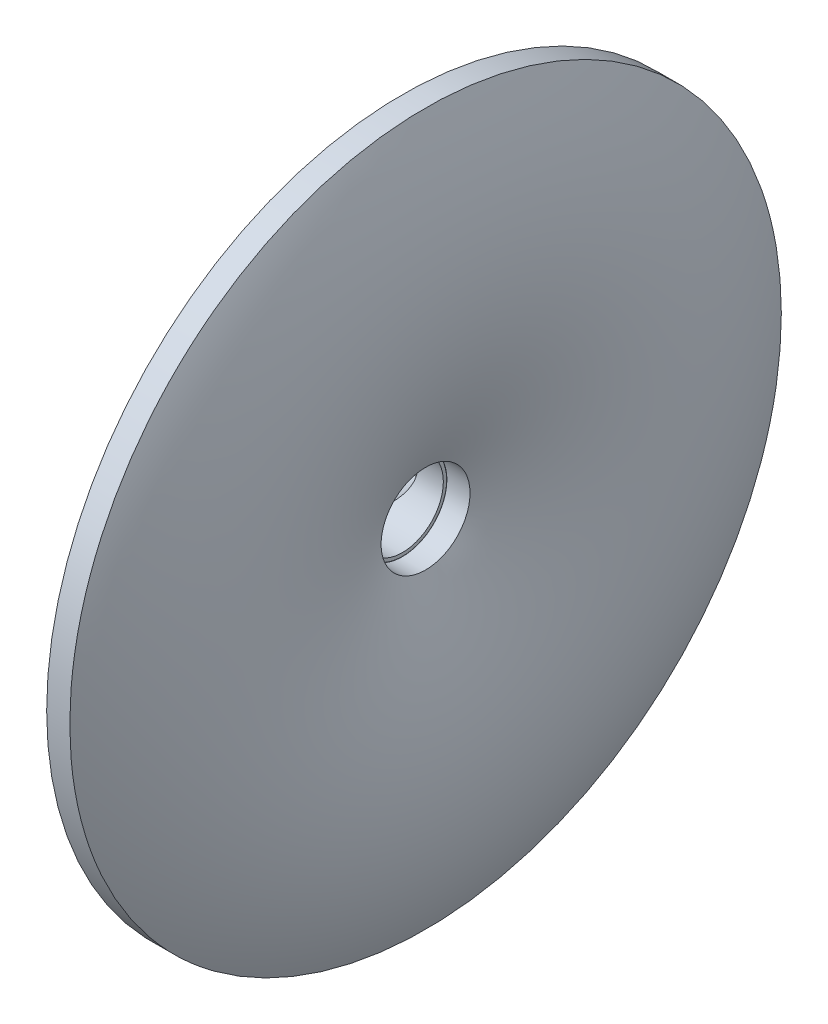
ISO-10303-21;
HEADER;
FILE_DESCRIPTION(('STEP AP214'),'2;1');
FILE_NAME('part.step','',(''),(''),'','','');
FILE_SCHEMA(('AUTOMOTIVE_DESIGN { 1 0 10303 214 1 1 1 1 }'));
ENDSEC;
DATA;
#1=APPLICATION_CONTEXT('core data for automotive mechanical design processes');
#2=APPLICATION_PROTOCOL_DEFINITION('international standard','automotive_design',2000,#1);
#3=PRODUCT_CONTEXT('',#1,'mechanical');
#4=PRODUCT('Part','Part','',(#3));
#5=PRODUCT_RELATED_PRODUCT_CATEGORY('part','',(#4));
#6=PRODUCT_DEFINITION_FORMATION('','',#4);
#7=PRODUCT_DEFINITION_CONTEXT('part definition',#1,'design');
#8=PRODUCT_DEFINITION('design','',#6,#7);
#9=PRODUCT_DEFINITION_SHAPE('','',#8);
#10=(LENGTH_UNIT() NAMED_UNIT(*) SI_UNIT(.MILLI.,.METRE.));
#11=(NAMED_UNIT(*) PLANE_ANGLE_UNIT() SI_UNIT($,.RADIAN.));
#12=(NAMED_UNIT(*) SI_UNIT($,.STERADIAN.) SOLID_ANGLE_UNIT());
#13=UNCERTAINTY_MEASURE_WITH_UNIT(LENGTH_MEASURE(1.E-05),#10,'distance_accuracy_value','');
#14=(GEOMETRIC_REPRESENTATION_CONTEXT(3) GLOBAL_UNCERTAINTY_ASSIGNED_CONTEXT((#13)) GLOBAL_UNIT_ASSIGNED_CONTEXT((#10,
#11,#12)) REPRESENTATION_CONTEXT('',''));
#15=CARTESIAN_POINT('',(0.,0.,0.));
#16=DIRECTION('',(0.,0.,1.));
#17=DIRECTION('',(1.,0.,0.));
#18=AXIS2_PLACEMENT_3D('',#15,#16,#17);
#19=CARTESIAN_POINT('',(25.9999999999999,0.,-50.));
#20=CARTESIAN_POINT('',(25.9999999999999,100.,-50.));
#21=CARTESIAN_POINT('',(25.9999999999999,100.,50.));
#22=CARTESIAN_POINT('',(25.9999999999999,0.,50.));
#23=CARTESIAN_POINT('',(25.9999999999999,-100.,50.));
#24=CARTESIAN_POINT('',(25.9999999999999,-100.,-50.));
#25=CARTESIAN_POINT('',(25.9999999999999,0.,-50.));
#26=CARTESIAN_POINT('',(108.308580160765,0.,-233.357652759936));
#27=CARTESIAN_POINT('',(108.308580160765,466.715305519872,-233.357652759936));
#28=CARTESIAN_POINT('',(108.308580160765,466.715305519872,233.357652759936));
#29=CARTESIAN_POINT('',(108.308580160765,0.,233.357652759936));
#30=CARTESIAN_POINT('',(108.308580160765,-466.715305519872,233.357652759936));
#31=CARTESIAN_POINT('',(108.308580160765,-466.715305519872,-233.357652759936));
#32=CARTESIAN_POINT('',(108.308580160765,0.,-233.357652759936));
#33=CARTESIAN_POINT('',(25.9999999999999,0.,-400.));
#34=CARTESIAN_POINT('',(25.9999999999999,800.,-400.));
#35=CARTESIAN_POINT('',(25.9999999999999,800.,400.));
#36=CARTESIAN_POINT('',(25.9999999999999,0.,400.));
#37=CARTESIAN_POINT('',(25.9999999999999,-800.,400.));
#38=CARTESIAN_POINT('',(25.9999999999999,-800.,-400.));
#39=CARTESIAN_POINT('',(25.9999999999999,0.,-400.));
#40=(BOUNDED_SURFACE() B_SPLINE_SURFACE(2,3,((#19,#20,#21,#22,#23,#24,#25),(#26,#27,#28,#29,#30,
#31,#32),(#33,#34,#35,#36,#37,#38,#39)),.UNSPECIFIED.,.F.,.T.,
.F.) B_SPLINE_SURFACE_WITH_KNOTS((3,3),(4,3,4),(0.,1.),(0.,0.5,1.),
.UNSPECIFIED.) GEOMETRIC_REPRESENTATION_ITEM() RATIONAL_B_SPLINE_SURFACE(((1.,0.333333333333333,
0.333333333333333,1.,0.333333333333333,0.333333333333333,1.),(1.,0.333333333333333,
0.333333333333333,1.,0.333333333333333,0.333333333333333,1.),(1.,0.333333333333333,
0.333333333333333,1.,0.333333333333333,0.333333333333333,1.))) REPRESENTATION_ITEM('') SURFACE());
#41=CARTESIAN_POINT('',(25.9999999999999,0.,-50.));
#42=CARTESIAN_POINT('',(108.308580160765,0.,-233.357652759936));
#43=CARTESIAN_POINT('',(25.9999999999999,0.,-400.));
#44=B_SPLINE_CURVE_WITH_KNOTS('',2,(#41,#42,#43),.UNSPECIFIED.,.F.,.F.,(3,3),(0.,1.),.UNSPECIFIED.);
#45=CARTESIAN_POINT('',(25.9999999999999,0.,-50.));
#46=VERTEX_POINT('',#45);
#47=CARTESIAN_POINT('',(25.9999999999999,0.,-400.));
#48=VERTEX_POINT('',#47);
#49=EDGE_CURVE('E97',#46,#48,#44,.T.);
#50=CARTESIAN_POINT('',(25.9999999999999,0.,0.));
#51=DIRECTION('',(1.,0.,0.));
#52=DIRECTION('',(0.,0.,-1.));
#53=AXIS2_PLACEMENT_3D('',#50,#51,#52);
#54=CIRCLE('',#53,50.);
#55=EDGE_CURVE('E84',#46,#46,#54,.T.);
#56=CARTESIAN_POINT('',(25.9999999999999,0.,0.));
#57=DIRECTION('',(1.,0.,0.));
#58=DIRECTION('',(0.,0.,-1.));
#59=AXIS2_PLACEMENT_3D('',#56,#57,#58);
#60=CIRCLE('',#59,400.);
#61=EDGE_CURVE('E15',#48,#48,#60,.T.);
#62=ORIENTED_EDGE('',*,*,#49,.F.);
#63=ORIENTED_EDGE('',*,*,#55,.F.);
#64=ORIENTED_EDGE('',*,*,#49,.T.);
#65=ORIENTED_EDGE('',*,*,#61,.T.);
#66=EDGE_LOOP('',(#62,#63,#64,#65));
#67=FACE_BOUND('',#66,.T.);
#68=ADVANCED_FACE('F81',(#67),#40,.T.);
#69=OPEN_SHELL('',(#68));
#70=SHELL_BASED_SURFACE_MODEL('B2',(#69));
#71=CARTESIAN_POINT('',(-76.7162892380863,0.,-83.1541397979577));
#72=DIRECTION('',(0.,0.,1.));
#73=DIRECTION('',(1.,0.,0.));
#74=AXIS2_PLACEMENT_3D('',#71,#72,#73);
#75=PLANE('',#74);
#76=CARTESIAN_POINT('',(-76.7162892380863,0.,-83.1541397979577));
#77=DIRECTION('',(0.,0.,-1.));
#78=DIRECTION('',(-1.,0.,0.));
#79=AXIS2_PLACEMENT_3D('',#76,#77,#78);
#80=CIRCLE('',#79,48.);
#81=CARTESIAN_POINT('',(-124.716289238086,0.,-83.1541397979577));
#82=VERTEX_POINT('',#81);
#83=EDGE_CURVE('E192',#82,#82,#80,.T.);
#84=ORIENTED_EDGE('',*,*,#83,.F.);
#85=EDGE_LOOP('',(#84));
#86=FACE_BOUND('',#85,.T.);
#87=CARTESIAN_POINT('',(-76.7162892380863,0.,-83.1541397979577));
#88=DIRECTION('',(0.,0.,1.));
#89=DIRECTION('',(1.,0.,0.));
#90=AXIS2_PLACEMENT_3D('',#87,#88,#89);
#91=CIRCLE('',#90,49.7455757095759);
#92=CARTESIAN_POINT('',(-26.9707135285104,0.,-83.1541397979577));
#93=VERTEX_POINT('',#92);
#94=EDGE_CURVE('E159',#93,#93,#91,.T.);
#95=ORIENTED_EDGE('',*,*,#94,.F.);
#96=EDGE_LOOP('',(#95));
#97=FACE_BOUND('',#96,.T.);
#98=ADVANCED_FACE('F140',(#86,#97),#75,.F.);
#99=CARTESIAN_POINT('',(0.,0.,0.));
#100=DIRECTION('',(1.,0.,0.));
#101=DIRECTION('',(0.,0.,-1.));
#102=AXIS2_PLACEMENT_3D('',#99,#100,#101);
#103=PLANE('',#102);
#104=CARTESIAN_POINT('',(0.,0.,0.));
#105=DIRECTION('',(1.,0.,0.));
#106=DIRECTION('',(0.,0.,-1.));
#107=AXIS2_PLACEMENT_3D('',#104,#105,#106);
#108=CIRCLE('',#107,46.);
#109=CARTESIAN_POINT('',(0.,0.,-46.));
#110=VERTEX_POINT('',#109);
#111=EDGE_CURVE('E185',#110,#110,#108,.T.);
#112=ORIENTED_EDGE('',*,*,#111,.F.);
#113=EDGE_LOOP('',(#112));
#114=FACE_BOUND('',#113,.T.);
#115=CARTESIAN_POINT('',(0.,0.,0.));
#116=DIRECTION('',(1.,0.,0.));
#117=DIRECTION('',(0.,0.,-1.));
#118=AXIS2_PLACEMENT_3D('',#115,#116,#117);
#119=CIRCLE('',#118,49.7455757095759);
#120=CARTESIAN_POINT('',(0.,0.,-49.7455757095759));
#121=VERTEX_POINT('',#120);
#122=EDGE_CURVE('E194',#121,#121,#119,.T.);
#123=ORIENTED_EDGE('',*,*,#122,.T.);
#124=EDGE_LOOP('',(#123));
#125=FACE_BOUND('',#124,.T.);
#126=ADVANCED_FACE('F238',(#114,#125),#103,.T.);
#127=CARTESIAN_POINT('',(-32.3050388317123,0.,49.3125689132431));
#128=CARTESIAN_POINT('',(-26.9707135285104,0.,-83.1541397979577));
#129=CARTESIAN_POINT('',(-32.3050388317123,99.4911514191517,49.3125689132431));
#130=CARTESIAN_POINT('',(-26.9707135285104,99.4911514191517,-83.1541397979577));
#131=CARTESIAN_POINT('',(-131.796190250864,99.4911514191517,49.3125689132431));
#132=CARTESIAN_POINT('',(-126.461864947662,99.4911514191517,-83.1541397979577));
#133=CARTESIAN_POINT('',(-131.796190250864,0.,49.3125689132431));
#134=CARTESIAN_POINT('',(-126.461864947662,0.,-83.1541397979577));
#135=CARTESIAN_POINT('',(-131.796190250864,-99.4911514191517,49.3125689132431));
#136=CARTESIAN_POINT('',(-126.461864947662,-99.4911514191517,-83.1541397979577));
#137=CARTESIAN_POINT('',(-32.3050388317123,-99.4911514191517,49.3125689132431));
#138=CARTESIAN_POINT('',(-26.9707135285104,-99.4911514191517,-83.1541397979577));
#139=CARTESIAN_POINT('',(-32.3050388317123,0.,49.3125689132431));
#140=CARTESIAN_POINT('',(-26.9707135285104,0.,-83.1541397979577));
#141=(BOUNDED_SURFACE() B_SPLINE_SURFACE(3,1,((#127,#128),(#129,#130),(#131,#132),(#133,#134),
(#135,#136),(#137,#138),(#139,#140)),.UNSPECIFIED.,.T.,.F.,.F.) B_SPLINE_SURFACE_WITH_KNOTS((4,
3,4),(2,2),(0.,0.5,1.),(0.,1.),
.UNSPECIFIED.) GEOMETRIC_REPRESENTATION_ITEM() RATIONAL_B_SPLINE_SURFACE(((1.,1.),
(0.333333333333333,0.333333333333333),(0.333333333333333,0.333333333333333),(1.,1.),
(0.333333333333333,0.333333333333333),(0.333333333333333,0.333333333333333),(1.,1.))) REPRESENTATION_ITEM('') SURFACE());
#142=CARTESIAN_POINT('',(-28.2702057478403,0.,-50.8839936208731));
#143=CARTESIAN_POINT('',(-28.2702055755946,-0.740094609916122,-50.8839937797835));
#144=CARTESIAN_POINT('',(-28.2873733905372,-1.48018612573514,-50.8681551088536));
#145=CARTESIAN_POINT('',(-28.3558743887472,-2.95744611573726,-50.8049575049274));
#146=CARTESIAN_POINT('',(-28.407208204199,-3.69461453557948,-50.7575979886908));
#147=CARTESIAN_POINT('',(-28.5435365125909,-5.16312607612669,-50.6318243114772));
#148=CARTESIAN_POINT('',(-28.6285297230418,-5.89446941769568,-50.5534113336979));
#149=CARTESIAN_POINT('',(-28.8314056429465,-7.34892657628311,-50.3662422067168));
#150=CARTESIAN_POINT('',(-28.949300449734,-8.07203726432385,-50.257474896765));
#151=CARTESIAN_POINT('',(-29.216889406493,-9.50727324737221,-50.0106028606461));
#152=CARTESIAN_POINT('',(-29.3665842389107,-10.2193983062703,-49.8724975048682));
#153=CARTESIAN_POINT('',(-29.6964811589979,-11.6304315263068,-49.5681414306949));
#154=CARTESIAN_POINT('',(-29.8766827418006,-12.3293399059599,-49.4018911780791));
#155=CARTESIAN_POINT('',(-30.2164619611026,-13.5356801442744,-49.0884178990771));
#156=CARTESIAN_POINT('',(-30.3695857532494,-14.046502775897,-48.947149055985));
#157=CARTESIAN_POINT('',(-30.6913112644889,-15.0590694461915,-48.6503317545796));
#158=CARTESIAN_POINT('',(-30.8599135050011,-15.5608131783422,-48.4947828152154));
#159=CARTESIAN_POINT('',(-31.211899903398,-16.5545259795851,-48.1700474452999));
#160=CARTESIAN_POINT('',(-31.3952822035472,-17.0464962674621,-48.0008627286571));
#161=CARTESIAN_POINT('',(-31.7761736133865,-18.0202435561059,-47.6494601931186));
#162=CARTESIAN_POINT('',(-31.9736843771145,-18.5020193548069,-47.4672408482415));
#163=CARTESIAN_POINT('',(-32.5864203720859,-19.931447850105,-46.9019432944333));
#164=CARTESIAN_POINT('',(-33.0218556830242,-20.8632195422209,-46.5002196840444));
#165=CARTESIAN_POINT('',(-33.9411118485304,-22.6815555084678,-45.6521329616248));
#166=CARTESIAN_POINT('',(-34.4249442568855,-23.5681089110479,-45.2057591903091));
#167=CARTESIAN_POINT('',(-35.286338052046,-25.0391801180414,-44.4110550938205));
#168=CARTESIAN_POINT('',(-35.6530522827088,-25.6355330596683,-44.0727321305188));
#169=CARTESIAN_POINT('',(-36.4061030192053,-26.8045648032843,-43.3779830987522));
#170=CARTESIAN_POINT('',(-36.7924353656918,-27.3772485771888,-43.0215608676149));
#171=CARTESIAN_POINT('',(-37.978871254156,-29.0601939480269,-41.9269796597157));
#172=CARTESIAN_POINT('',(-38.8062827213726,-30.135127884226,-41.1636269560244));
#173=CARTESIAN_POINT('',(-40.5232190069867,-32.1921273994419,-39.5796170557287));
#174=CARTESIAN_POINT('',(-41.4128449168767,-33.1740354270623,-38.7588665942046));
#175=CARTESIAN_POINT('',(-43.2432783279767,-35.0449911828831,-37.0701465937548));
#176=CARTESIAN_POINT('',(-44.1840871874406,-35.9340364449327,-36.2021758017322));
#177=CARTESIAN_POINT('',(-46.0346016078928,-37.5568374426403,-34.4949294774531));
#178=CARTESIAN_POINT('',(-46.9411598924783,-38.2972734326588,-33.6585575573006));
#179=CARTESIAN_POINT('',(-48.7854185628215,-39.7033137104837,-31.9570826586646));
#180=CARTESIAN_POINT('',(-49.7231288741018,-40.368893846013,-31.0919705230991));
#181=CARTESIAN_POINT('',(-51.6246582868012,-41.6270988245606,-29.3376588222768));
#182=CARTESIAN_POINT('',(-52.5884797417804,-42.2197170641955,-28.4484570856739));
#183=CARTESIAN_POINT('',(-54.5389153707376,-43.3344774565215,-26.6490255214138));
#184=CARTESIAN_POINT('',(-55.5255502903383,-43.8565522505559,-25.7387765542741));
#185=CARTESIAN_POINT('',(-57.5169703684399,-44.8313564749374,-23.9015335850439));
#186=CARTESIAN_POINT('',(-58.5217530939953,-45.2840951246632,-22.9745418275388));
#187=CARTESIAN_POINT('',(-60.5464679461563,-46.1219897708378,-21.1065817885024));
#188=CARTESIAN_POINT('',(-61.5664013947632,-46.5071398317138,-20.1656122873202));
#189=CARTESIAN_POINT('',(-63.8838542945738,-47.3022925319065,-18.0275781811471));
#190=CARTESIAN_POINT('',(-65.1849708387986,-47.692979730591,-16.8271949725451));
#191=CARTESIAN_POINT('',(-67.801755980709,-48.37189158548,-14.4130031318443));
#192=CARTESIAN_POINT('',(-69.1174275155699,-48.6600951568718,-13.1991917899683));
#193=CARTESIAN_POINT('',(-71.7586949378966,-49.1356863410714,-10.7624131037996));
#194=CARTESIAN_POINT('',(-73.0842918260236,-49.3230636460754,-9.53944483631772));
#195=CARTESIAN_POINT('',(-75.7426145827251,-49.5982355742918,-7.08693125146418));
#196=CARTESIAN_POINT('',(-77.0753470268072,-49.6859122020473,-5.85737986766532));
#197=CARTESIAN_POINT('',(-79.7421867363382,-49.7618061925821,-3.39700871831437));
#198=CARTESIAN_POINT('',(-81.0762938298116,-49.7500347695751,-2.16618911142323));
#199=CARTESIAN_POINT('',(-83.7419987513864,-49.6269902690049,0.293135106033791));
#200=CARTESIAN_POINT('',(-85.0735966433159,-49.5157197576582,1.52163977548616));
#201=CARTESIAN_POINT('',(-87.7387302876775,-49.1919830481155,3.98043694440377));
#202=CARTESIAN_POINT('',(-89.0722240660812,-48.978874852019,5.21069071949876));
#203=CARTESIAN_POINT('',(-91.7282625105164,-48.4499042119137,7.66109684510897));
#204=CARTESIAN_POINT('',(-93.0508065918097,-48.1340363161429,8.88124865615692));
#205=CARTESIAN_POINT('',(-95.6804590023915,-47.3975406782925,11.3073115727597));
#206=CARTESIAN_POINT('',(-96.9875631632826,-46.9768852939604,12.5132188326373));
#207=CARTESIAN_POINT('',(-99.5779098276257,-46.0293263856167,14.9030190808449));
#208=CARTESIAN_POINT('',(-100.861196937691,-45.5026493766679,16.0869532223136));
#209=CARTESIAN_POINT('',(-103.400387128014,-44.3395141965656,18.4295575658213));
#210=CARTESIAN_POINT('',(-104.656296152236,-43.7030801272395,19.5882332516388));
#211=CARTESIAN_POINT('',(-107.133239510804,-42.3170673459966,21.8734099558167));
#212=CARTESIAN_POINT('',(-108.354293623053,-41.5675543803029,22.9999292208617));
#213=CARTESIAN_POINT('',(-110.646020660022,-40.0236522876831,25.1142291781464));
#214=CARTESIAN_POINT('',(-111.720352741115,-39.2393330918135,26.1053857323618));
#215=CARTESIAN_POINT('',(-113.826022030423,-37.5701675201192,28.0480326604735));
#216=CARTESIAN_POINT('',(-114.85736360453,-36.6853313864384,28.9995270622521));
#217=CARTESIAN_POINT('',(-116.866920998366,-34.8129992126041,30.8535031437872));
#218=CARTESIAN_POINT('',(-117.845194629139,-33.8256184460284,31.7560381588178));
#219=CARTESIAN_POINT('',(-119.738903389325,-31.7448457395483,33.5031346874102));
#220=CARTESIAN_POINT('',(-120.654352455407,-30.6514774420408,34.3477090586558));
#221=CARTESIAN_POINT('',(-122.21393486313,-28.6130531900983,35.7865475262558));
#222=CARTESIAN_POINT('',(-122.873076323674,-27.6892236042301,36.3946578026502));
#223=CARTESIAN_POINT('',(-124.138711366886,-25.7768448115918,37.5623065123943));
#224=CARTESIAN_POINT('',(-124.745207951337,-24.7882993005328,38.1218477151251));
#225=CARTESIAN_POINT('',(-125.897279587358,-22.7487887940705,39.1847251745852));
#226=CARTESIAN_POINT('',(-126.442909878763,-21.6978817448603,39.6881123944418));
#227=CARTESIAN_POINT('',(-127.465476145115,-19.5358187153241,40.6315108788132));
#228=CARTESIAN_POINT('',(-127.942424595508,-18.424673727282,41.071533652915));
#229=CARTESIAN_POINT('',(-128.741897985936,-16.3475092508492,41.8091112648925));
#230=CARTESIAN_POINT('',(-129.07683077587,-15.3903063429373,42.1181133284144));
#231=CARTESIAN_POINT('',(-129.689401369305,-13.4423464875184,42.6832582861859));
#232=CARTESIAN_POINT('',(-129.967045277638,-12.451593128336,42.9394068126294));
#233=CARTESIAN_POINT('',(-130.337086239272,-10.9448437574599,43.2807989491074));
#234=CARTESIAN_POINT('',(-130.452686410512,-10.4392095238899,43.3874492757703));
#235=CARTESIAN_POINT('',(-130.667969208023,-9.42172332561556,43.5860647313803));
#236=CARTESIAN_POINT('',(-130.767653451993,-8.90987199851637,43.6780313527833));
#237=CARTESIAN_POINT('',(-130.950665088014,-7.88072403107055,43.846874102369));
#238=CARTESIAN_POINT('',(-131.033990651236,-7.36342678869798,43.9237485433121));
#239=CARTESIAN_POINT('',(-131.18387922435,-6.32440102269657,44.062032640249));
#240=CARTESIAN_POINT('',(-131.250443400907,-5.80267281009679,44.1234433725832));
#241=CARTESIAN_POINT('',(-131.386155952696,-4.57828941988709,44.2486489654929));
#242=CARTESIAN_POINT('',(-131.448539024913,-3.87422392760545,44.306202297454));
#243=CARTESIAN_POINT('',(-131.542126699418,-2.46226364536431,44.3925443499829));
#244=CARTESIAN_POINT('',(-131.573330402714,-1.75436874558342,44.4213322411591));
#245=CARTESIAN_POINT('',(-131.604277715833,-0.337312932844498,44.4498835920619));
#246=CARTESIAN_POINT('',(-131.604021992556,0.371847952957564,44.4496476670564));
#247=CARTESIAN_POINT('',(-131.572054104952,1.78884286481152,44.4201547552461));
#248=CARTESIAN_POINT('',(-131.540342235618,2.49667690324408,44.3908980405954));
#249=CARTESIAN_POINT('',(-131.445746323265,3.90849391657253,44.3036258086843));
#250=CARTESIAN_POINT('',(-131.382861731824,4.61247682349514,44.2456097854614));
#251=CARTESIAN_POINT('',(-131.226496043459,6.01403169394612,44.1013500359804));
#252=CARTESIAN_POINT('',(-131.133016862444,6.71160405610739,44.0151080773012));
#253=CARTESIAN_POINT('',(-130.872391874914,8.37856245183558,43.7746608551354));
#254=CARTESIAN_POINT('',(-130.690742677086,9.34380957185882,43.6070750628423));
#255=CARTESIAN_POINT('',(-130.271567961008,11.2513373111949,43.2203531409028));
#256=CARTESIAN_POINT('',(-130.034046572837,12.1936196223896,43.0012208215806));
#257=CARTESIAN_POINT('',(-129.50656412173,14.0508011023233,42.5145764237732));
#258=CARTESIAN_POINT('',(-129.216591395296,14.9656941277179,42.2470535847866));
#259=CARTESIAN_POINT('',(-128.588110058083,16.7640836213198,41.6672297039372));
#260=CARTESIAN_POINT('',(-128.249594271067,17.6475754232686,41.3549220414261));
#261=CARTESIAN_POINT('',(-127.400527176651,19.686369969669,40.5715903040528));
#262=CARTESIAN_POINT('',(-126.871445247466,20.8274479326022,40.0834702608572));
#263=CARTESIAN_POINT('',(-125.741605468711,23.0418846385777,39.0411034530203));
#264=CARTESIAN_POINT('',(-125.140827394219,24.1152241419641,38.4868380292829));
#265=CARTESIAN_POINT('',(-123.876048976088,26.1930654629875,37.3199796241189));
#266=CARTESIAN_POINT('',(-123.211955276727,27.1974617568163,36.7073005146342));
#267=CARTESIAN_POINT('',(-121.82985559783,29.1347562289716,35.4322039412132));
#268=CARTESIAN_POINT('',(-121.111847049767,30.0676509966517,34.7697841076079));
#269=CARTESIAN_POINT('',(-119.357598604249,32.1913681945315,33.15135078043));
#270=CARTESIAN_POINT('',(-118.301175086245,33.3514051276301,32.1767162960605));
#271=CARTESIAN_POINT('',(-116.117958337258,35.5416202014967,30.1625256858078));
#272=CARTESIAN_POINT('',(-114.991140916539,36.5717533317486,29.1229472429733));
#273=CARTESIAN_POINT('',(-112.679387535549,38.5072123444485,26.9901713949626));
#274=CARTESIAN_POINT('',(-111.494383339757,39.4123867086059,25.8969110371066));
#275=CARTESIAN_POINT('',(-109.078570467917,41.1009557763588,23.6681320554295));
#276=CARTESIAN_POINT('',(-107.847761241912,41.8843490172063,22.5326129242293));
#277=CARTESIAN_POINT('',(-105.472379056574,43.2623931767567,20.3411344575628));
#278=CARTESIAN_POINT('',(-104.331226456119,43.8680285609296,19.2883306744435));
#279=CARTESIAN_POINT('',(-102.024382316605,44.9868760505878,17.1600839910653));
#280=CARTESIAN_POINT('',(-100.858683796129,45.500061453539,16.0846346498959));
#281=CARTESIAN_POINT('',(-98.5078258597499,46.436351476447,13.9157817480066));
#282=CARTESIAN_POINT('',(-97.3226642749192,46.8594459824582,12.8223761862793));
#283=CARTESIAN_POINT('',(-94.9364223739051,47.6178629520361,10.620878770576));
#284=CARTESIAN_POINT('',(-93.7353313966931,47.9531231561888,9.51277708095547));
#285=CARTESIAN_POINT('',(-91.322047575552,48.5371234905869,7.28633134913634));
#286=CARTESIAN_POINT('',(-90.1098563458371,48.785876002099,6.16798879617829));
#287=CARTESIAN_POINT('',(-87.677710563649,49.1981805203022,3.92414140927866));
#288=CARTESIAN_POINT('',(-86.4577561172165,49.3617336882452,2.79863667316802));
#289=CARTESIAN_POINT('',(-83.9917261678339,49.6066174822724,0.523528454547948));
#290=CARTESIAN_POINT('',(-82.7455700442783,49.6864439969149,-0.626149406864497));
#291=CARTESIAN_POINT('',(-80.2518614376591,49.7591396954724,-2.9267933820861));
#292=CARTESIAN_POINT('',(-79.0043089188172,49.7520065978445,-4.07775952890357));
#293=CARTESIAN_POINT('',(-76.5110013842016,49.6507362330504,-6.37803348339117));
#294=CARTESIAN_POINT('',(-75.2652465306044,49.5565915543452,-7.52734114144073));
#295=CARTESIAN_POINT('',(-72.7793826289665,49.280840050184,-9.82074775412333));
#296=CARTESIAN_POINT('',(-71.5392718258651,49.0992625991759,-10.9648483279392));
#297=CARTESIAN_POINT('',(-69.0678505357407,48.6477273681166,-13.2449304860016));
#298=CARTESIAN_POINT('',(-67.8365393968664,48.3777762053299,-14.3809126716326));
#299=CARTESIAN_POINT('',(-65.3864955202233,47.7481145396742,-16.6412724702336));
#300=CARTESIAN_POINT('',(-64.1677610440924,47.3884166195636,-17.7656516869805));
#301=CARTESIAN_POINT('',(-61.9401745996483,46.6421486698508,-19.8207768604239));
#302=CARTESIAN_POINT('',(-60.928879445235,46.2690378270316,-20.7537768500763));
#303=CARTESIAN_POINT('',(-58.9207386305247,45.4567589510322,-22.6064460250138));
#304=CARTESIAN_POINT('',(-57.9238921455068,45.017594704547,-23.5261159711694));
#305=CARTESIAN_POINT('',(-55.9475218050361,44.0715619065727,-25.3494743637825));
#306=CARTESIAN_POINT('',(-54.9680002860755,43.5646843007342,-26.2531606546405));
#307=CARTESIAN_POINT('',(-53.0309314247439,42.4820868741844,-28.0402603155964));
#308=CARTESIAN_POINT('',(-52.0733611953734,41.9064430425642,-28.9236948007665));
#309=CARTESIAN_POINT('',(-50.183123181233,40.6839925247134,-30.667589290854));
#310=CARTESIAN_POINT('',(-49.2504530698816,40.0371925161938,-31.5280514422273));
#311=CARTESIAN_POINT('',(-47.414786386396,38.670571771931,-33.2215995515237));
#312=CARTESIAN_POINT('',(-46.5117805973294,37.9507740067555,-34.0546940127978));
#313=CARTESIAN_POINT('',(-44.6787726655026,36.3832121700229,-35.7457892128132));
#314=CARTESIAN_POINT('',(-43.7512622679666,35.5300294769535,-36.6014911189552));
#315=CARTESIAN_POINT('',(-41.9435250510586,33.735304049224,-38.2692720801404));
#316=CARTESIAN_POINT('',(-41.0632958398354,32.7937657909098,-39.0813533418561));
#317=CARTESIAN_POINT('',(-39.3599608252333,30.8215933893271,-40.6528149908741));
#318=CARTESIAN_POINT('',(-38.5367935829088,29.791057842878,-41.4122520604767));
#319=CARTESIAN_POINT('',(-36.957076473736,27.6393543617732,-42.869666387125));
#320=CARTESIAN_POINT('',(-36.2005110589694,26.5182076977502,-43.5676579883584));
#321=CARTESIAN_POINT('',(-34.9235870393149,24.4425607148238,-44.7457216742422));
#322=CARTESIAN_POINT('',(-34.3878484363749,23.5055525212815,-45.2399830269423));
#323=CARTESIAN_POINT('',(-33.3705085299567,21.5785745190256,-46.1785597797517));
#324=CARTESIAN_POINT('',(-32.8889019602959,20.5886098759825,-46.6228800383321));
#325=CARTESIAN_POINT('',(-31.9866772100379,18.5588610957179,-47.4552539293582));
#326=CARTESIAN_POINT('',(-31.5660262486608,17.5191041391656,-47.8433378046732));
#327=CARTESIAN_POINT('',(-30.9858120915162,15.925507770092,-48.3786313836543));
#328=CARTESIAN_POINT('',(-30.8008479622504,15.3885801240817,-48.5492754631181));
#329=CARTESIAN_POINT('',(-30.4486488808819,14.3040853002637,-48.8742070499435));
#330=CARTESIAN_POINT('',(-30.2814124119748,13.7565190374628,-49.0284959566776));
#331=CARTESIAN_POINT('',(-29.9232328568344,12.5038272151976,-49.3589450048919));
#332=CARTESIAN_POINT('',(-29.7379037714003,11.7957130883057,-49.529925785367));
#333=CARTESIAN_POINT('',(-29.3985621719356,10.3657296113422,-49.8429953253599));
#334=CARTESIAN_POINT('',(-29.2445492185352,9.64386045441104,-49.9850844902311));
#335=CARTESIAN_POINT('',(-28.9692026640311,8.18866845756201,-50.2391135255548));
#336=CARTESIAN_POINT('',(-28.8478682517899,7.45534590241532,-50.351054144346));
#337=CARTESIAN_POINT('',(-28.6390670936205,5.98019462604617,-50.5436897735797));
#338=CARTESIAN_POINT('',(-28.5515833685069,5.23837036196346,-50.6244004486675));
#339=CARTESIAN_POINT('',(-28.4112502683483,3.74863968873355,-50.7538688639215));
#340=CARTESIAN_POINT('',(-28.358402289151,3.00073303569088,-50.8026253163074));
#341=CARTESIAN_POINT('',(-28.2878809305943,1.50188309847576,-50.8676868628959));
#342=CARTESIAN_POINT('',(-28.2702059226102,0.750939956516218,-50.8839934596341));
#343=CARTESIAN_POINT('',(-28.2702057478403,0.,-50.8839936208731));
#344=B_SPLINE_CURVE_WITH_KNOTS('',3,(#142,#143,#144,#145,#146,#147,#148,#149,#150,#151,#152,
#153,#154,#155,#156,#157,#158,#159,#160,#161,#162,#163,#164,#165,#166,#167,#168,#169,#170,#171,
#172,#173,#174,#175,#176,#177,#178,#179,#180,#181,#182,#183,#184,#185,#186,#187,#188,#189,#190,
#191,#192,#193,#194,#195,#196,#197,#198,#199,#200,#201,#202,#203,#204,#205,#206,#207,#208,#209,
#210,#211,#212,#213,#214,#215,#216,#217,#218,#219,#220,#221,#222,#223,#224,#225,#226,#227,#228,
#229,#230,#231,#232,#233,#234,#235,#236,#237,#238,#239,#240,#241,#242,#243,#244,#245,#246,#247,
#248,#249,#250,#251,#252,#253,#254,#255,#256,#257,#258,#259,#260,#261,#262,#263,#264,#265,#266,
#267,#268,#269,#270,#271,#272,#273,#274,#275,#276,#277,#278,#279,#280,#281,#282,#283,#284,#285,
#286,#287,#288,#289,#290,#291,#292,#293,#294,#295,#296,#297,#298,#299,#300,#301,#302,#303,#304,
#305,#306,#307,#308,#309,#310,#311,#312,#313,#314,#315,#316,#317,#318,#319,#320,#321,#322,#323,
#324,#325,#326,#327,#328,#329,#330,#331,#332,#333,#334,#335,#336,#337,#338,#339,#340,#341,#342,
#343),.UNSPECIFIED.,.T.,.F.,(4,2,2,2,2,2,2,2,2,2,2,2,2,2,2,2,2,2,2,2,2,2,2,2,2,2,2,2,2,2,2,2,2,
2,2,2,2,2,2,2,2,2,2,2,2,2,2,2,2,2,2,2,2,2,2,2,2,2,2,2,2,2,2,2,2,2,2,2,2,2,2,2,2,2,2,2,2,2,2,2,2,
2,2,2,2,2,2,2,2,2,2,2,2,2,2,2,2,2,2,2,4),(0.,2.21991187123897,4.43986481935833,6.65973319104599,
8.88041884678375,11.1011521644833,13.3218487340822,14.9764127996444,16.6310326226481,
18.2854447964944,19.9400509725599,23.2492038231756,26.5591485583007,28.8909700627334,
31.2222992320518,35.8858077020844,40.5570782844293,45.228472889905,49.541644802514,
53.8562043936926,58.1711541855356,62.4901954379599,66.8086619033993,71.1275074233387,
76.5628547650897,81.999319720129,87.4363403574738,92.8797890174452,98.322623857625,
103.765318323759,109.242786199959,114.720544722419,120.199749774711,125.667370438941,
131.133791979941,136.597047401269,141.569825793875,146.542097940407,151.508839892721,
156.474476463636,160.333831757062,164.192966847486,168.048570545113,171.903473020898,
175.080856421525,178.257901057837,179.846102578383,181.434142570767,183.022359998094,
184.610466848103,186.736632935362,188.862860324431,190.989042640195,193.115205017021,
195.241404800752,197.367471461988,200.35317275111,203.338653406221,206.324798754553,
209.311386007916,213.352942621404,217.395642033496,221.444397206026,225.493345385485,
231.026304004861,236.561174508293,242.102698432157,247.644288911713,252.640991287944,
257.639134567023,262.637838661126,267.640076448537,272.641598004222,277.643051388271,
282.732890291457,287.822862736073,292.913268778213,298.00196580845,303.090281893321,
308.177884981833,312.453215268267,316.728300552865,321.003958057386,325.274933771518,
329.545509013712,333.814744558108,338.380962564619,342.946949358216,347.507941009621,
352.067865077328,355.6261316419,359.184051743785,362.74005130512,364.518492289965,
366.296780985779,368.550456393078,370.804100178812,373.057688020079,375.310144013068,
377.562690776218,379.815133236577),.UNSPECIFIED.);
#345=CARTESIAN_POINT('',(-28.2702057478403,0.,-50.8839936208732));
#346=VERTEX_POINT('',#345);
#347=EDGE_CURVE('E178',#346,#346,#344,.T.);
#348=ORIENTED_EDGE('',*,*,#347,.T.);
#349=EDGE_LOOP('',(#348));
#350=FACE_BOUND('',#349,.T.);
#351=ORIENTED_EDGE('',*,*,#94,.T.);
#352=EDGE_LOOP('',(#351));
#353=FACE_BOUND('',#352,.T.);
#354=ADVANCED_FACE('F233',(#350,#353),#141,.F.);
#355=CARTESIAN_POINT('',(0.,0.,-49.7455757095759));
#356=CARTESIAN_POINT('',(-136.866643183369,0.,-55.2570827516137));
#357=CARTESIAN_POINT('',(0.,99.4911514191517,-49.7455757095759));
#358=CARTESIAN_POINT('',(-136.866643183369,99.4911514191517,-55.2570827516137));
#359=CARTESIAN_POINT('',(0.,99.4911514191517,49.7455757095759));
#360=CARTESIAN_POINT('',(-136.866643183369,99.4911514191517,44.234068667538));
#361=CARTESIAN_POINT('',(0.,0.,49.7455757095759));
#362=CARTESIAN_POINT('',(-136.866643183369,0.,44.234068667538));
#363=CARTESIAN_POINT('',(0.,-99.4911514191517,49.7455757095759));
#364=CARTESIAN_POINT('',(-136.866643183369,-99.4911514191517,44.234068667538));
#365=CARTESIAN_POINT('',(0.,-99.4911514191517,-49.7455757095759));
#366=CARTESIAN_POINT('',(-136.866643183369,-99.4911514191517,-55.2570827516137));
#367=CARTESIAN_POINT('',(0.,0.,-49.7455757095759));
#368=CARTESIAN_POINT('',(-136.866643183369,0.,-55.2570827516137));
#369=(BOUNDED_SURFACE() B_SPLINE_SURFACE(3,1,((#355,#356),(#357,#358),(#359,#360),(#361,#362),
(#363,#364),(#365,#366),(#367,#368)),.UNSPECIFIED.,.T.,.F.,.F.) B_SPLINE_SURFACE_WITH_KNOTS((4,
3,4),(2,2),(0.,0.5,1.),(0.,1.),
.UNSPECIFIED.) GEOMETRIC_REPRESENTATION_ITEM() RATIONAL_B_SPLINE_SURFACE(((1.,1.),
(0.333333333333333,0.333333333333333),(0.333333333333333,0.333333333333333),(1.,1.),
(0.333333333333333,0.333333333333333),(0.333333333333333,0.333333333333333),(1.,1.))) REPRESENTATION_ITEM('') SURFACE());
#370=ORIENTED_EDGE('',*,*,#122,.F.);
#371=EDGE_LOOP('',(#370));
#372=FACE_BOUND('',#371,.T.);
#373=ORIENTED_EDGE('',*,*,#347,.F.);
#374=EDGE_LOOP('',(#373));
#375=FACE_BOUND('',#374,.T.);
#376=ADVANCED_FACE('F215',(#372,#375),#369,.F.);
#377=CARTESIAN_POINT('',(-76.7162892380863,0.,-3.15413979795767));
#378=DIRECTION('',(0.,0.,-1.));
#379=DIRECTION('',(-1.,0.,0.));
#380=AXIS2_PLACEMENT_3D('',#377,#378,#379);
#381=CYLINDRICAL_SURFACE('',#380,48.);
#382=CARTESIAN_POINT('',(-76.7162892380863,0.,-3.15413979795767));
#383=DIRECTION('',(0.,0.,-1.));
#384=DIRECTION('',(-1.,0.,0.));
#385=AXIS2_PLACEMENT_3D('',#382,#383,#384);
#386=CIRCLE('',#385,48.);
#387=CARTESIAN_POINT('',(-62.6468685725059,-45.8917356626979,-3.15413979795767));
#388=VERTEX_POINT('',#387);
#389=CARTESIAN_POINT('',(-62.6468685725059,45.8917356626979,-3.15413979795767));
#390=VERTEX_POINT('',#389);
#391=EDGE_CURVE('E190',#388,#390,#386,.T.);
#392=ORIENTED_EDGE('',*,*,#391,.F.);
#393=CARTESIAN_POINT('',(-62.6468685725059,-45.8917356626979,-3.15413979795767));
#394=CARTESIAN_POINT('',(-62.5527147058752,-45.8628671450584,-3.57427896842205));
#395=CARTESIAN_POINT('',(-62.4416341250417,-45.8285012217468,-3.98985315460026));
#396=CARTESIAN_POINT('',(-62.1908157250914,-45.7496216632609,-4.81056786201394));
#397=CARTESIAN_POINT('',(-62.0511262719425,-45.7051251408156,-5.21572471033678));
#398=CARTESIAN_POINT('',(-61.7489509735667,-45.6070584540113,-6.01303889769735));
#399=CARTESIAN_POINT('',(-61.5866238443152,-45.5535509666206,-6.40526505673957));
#400=CARTESIAN_POINT('',(-61.2426923043469,-45.4378790425387,-7.18000876637749));
#401=CARTESIAN_POINT('',(-61.0610789830454,-45.3757106001492,-7.56252172727361));
#402=CARTESIAN_POINT('',(-60.4973055723069,-45.1785453010313,-8.68764768358985));
#403=CARTESIAN_POINT('',(-60.0925918736837,-45.0317446721343,-9.41689494784052));
#404=CARTESIAN_POINT('',(-59.2429967486166,-44.708966752493,-10.8464886539056));
#405=CARTESIAN_POINT('',(-58.7980288992225,-44.5329259741214,-11.5467679736777));
#406=CARTESIAN_POINT('',(-57.8900785363258,-44.1566670773562,-12.9104650252057));
#407=CARTESIAN_POINT('',(-57.4275399319807,-43.9569190814847,-13.5743105277373));
#408=CARTESIAN_POINT('',(-56.4860116193986,-43.5316316609087,-14.8818573269903));
#409=CARTESIAN_POINT('',(-56.0070187610614,-43.3060872781198,-15.5255547208477));
#410=CARTESIAN_POINT('',(-55.038747033959,-42.8296086365581,-16.7953655837931));
#411=CARTESIAN_POINT('',(-54.5494697460981,-42.5786782577886,-17.4214817213733));
#412=CARTESIAN_POINT('',(-53.564964607935,-42.0514925639869,-18.65807186086));
#413=CARTESIAN_POINT('',(-53.0697371936838,-41.7752390950221,-19.2685469988592));
#414=CARTESIAN_POINT('',(-52.0720425847419,-41.1946276647139,-20.4806825168986));
#415=CARTESIAN_POINT('',(-51.5695507466933,-40.8900339553913,-21.082209634758));
#416=CARTESIAN_POINT('',(-50.5645874916669,-40.2547134358168,-22.2713365964849));
#417=CARTESIAN_POINT('',(-50.0621160752642,-39.9239861252929,-22.8589361734595));
#418=CARTESIAN_POINT('',(-49.0595782691565,-39.2361545067273,-24.0203997349699));
#419=CARTESIAN_POINT('',(-48.5595114692864,-38.8790548803593,-24.594266133616));
#420=CARTESIAN_POINT('',(-47.5637457497137,-38.1380970862057,-25.7282765581281));
#421=CARTESIAN_POINT('',(-47.0680467629228,-37.7542393302272,-26.2884207949987));
#422=CARTESIAN_POINT('',(-45.6444496245331,-36.6056187928361,-27.8870302492087));
#423=CARTESIAN_POINT('',(-44.7244048913135,-35.8058152767661,-28.9076635709713));
#424=CARTESIAN_POINT('',(-42.9182603927874,-34.1061817087569,-30.894616297523));
#425=CARTESIAN_POINT('',(-42.0321639178428,-33.206341993837,-31.8609304417624));
#426=CARTESIAN_POINT('',(-40.3093246351363,-31.3076639155761,-33.7282688941847));
#427=CARTESIAN_POINT('',(-39.4724014416209,-30.3092287939221,-34.6295350185772));
#428=CARTESIAN_POINT('',(-37.8572674622335,-28.2086928655683,-36.3609773440835));
#429=CARTESIAN_POINT('',(-37.0790352484705,-27.1066302263649,-37.1911795055188));
#430=CARTESIAN_POINT('',(-35.7964083478264,-25.1110453901433,-38.5548260711936));
#431=CARTESIAN_POINT('',(-35.2748982827145,-24.2417886665799,-39.1077826194682));
#432=CARTESIAN_POINT('',(-34.276845412218,-22.4487409563047,-40.163867064343));
#433=CARTESIAN_POINT('',(-33.8002989248481,-21.5249544450263,-40.6669990411539));
#434=CARTESIAN_POINT('',(-32.8989545629379,-19.6251407754003,-41.6170799994504));
#435=CARTESIAN_POINT('',(-32.4741357883555,-18.6491349466924,-42.0640516742623));
#436=CARTESIAN_POINT('',(-31.6829336684149,-16.6479398542123,-42.8954475631532));
#437=CARTESIAN_POINT('',(-31.3165422142819,-15.6227574410954,-43.2798804567612));
#438=CARTESIAN_POINT('',(-30.6984924612239,-13.6835402276143,-43.9277313810297));
#439=CARTESIAN_POINT('',(-30.4378787071792,-12.7755230576839,-44.2006394379437));
#440=CARTESIAN_POINT('',(-29.968051882956,-10.9319184565322,-44.6923142586881));
#441=CARTESIAN_POINT('',(-29.7588338811705,-9.99633368017741,-44.9110862170866));
#442=CARTESIAN_POINT('',(-29.3954447255965,-8.10345013173242,-45.2908972769875));
#443=CARTESIAN_POINT('',(-29.241246101591,-7.14616245016351,-45.451965189279));
#444=CARTESIAN_POINT('',(-28.9905908297957,-5.21582805792501,-45.7137147054986));
#445=CARTESIAN_POINT('',(-28.8941348287893,-4.24278117085968,-45.8143956330234));
#446=CARTESIAN_POINT('',(-28.7606516837043,-2.28520281658823,-45.9537112094503));
#447=CARTESIAN_POINT('',(-28.723804922292,-1.30064553792943,-45.9921575313152));
#448=CARTESIAN_POINT('',(-28.7108495515601,0.669307874959472,-46.0056762081555));
#449=CARTESIAN_POINT('',(-28.734741011894,1.65470401015027,-45.9807484904546));
#450=CARTESIAN_POINT('',(-28.8427806337293,3.61863271567588,-45.8679963024399));
#451=CARTESIAN_POINT('',(-28.9269344296411,4.59716463558053,-45.7801659508528));
#452=CARTESIAN_POINT('',(-29.1538395519628,6.5398627788749,-45.5432517489375));
#453=CARTESIAN_POINT('',(-29.2965904482429,7.50402910766085,-45.3941683482349));
#454=CARTESIAN_POINT('',(-29.6304880835701,9.36938990080324,-45.0452562714789));
#455=CARTESIAN_POINT('',(-29.8192336362625,10.2714901454316,-44.8479441973639));
#456=CARTESIAN_POINT('',(-30.2447889459069,12.0514301444477,-44.402754565904));
#457=CARTESIAN_POINT('',(-30.4815958785918,12.9292713209469,-44.1548799797976));
#458=CARTESIAN_POINT('',(-30.9998783036868,14.6568559770641,-43.6118881096064));
#459=CARTESIAN_POINT('',(-31.2813648283489,15.5065924543074,-43.3167591573506));
#460=CARTESIAN_POINT('',(-31.8853445241703,17.174791717531,-42.6828171709654));
#461=CARTESIAN_POINT('',(-32.2078460058211,17.9932481216813,-42.343995283535));
#462=CARTESIAN_POINT('',(-32.7865587034098,19.353224755965,-41.7352038488038));
#463=CARTESIAN_POINT('',(-33.0332238702498,19.9034751807114,-41.4755037333702));
#464=CARTESIAN_POINT('',(-33.543282036471,20.9868984762926,-40.9379499146417));
#465=CARTESIAN_POINT('',(-33.8066716683837,21.5200747526854,-40.6600998655114));
#466=CARTESIAN_POINT('',(-34.6203530725087,23.093873129594,-39.8007771888586));
#467=CARTESIAN_POINT('',(-35.1940817695464,24.1085886783258,-39.1936114599991));
#468=CARTESIAN_POINT('',(-36.3951324768945,26.0677377690838,-37.9188795433024));
#469=CARTESIAN_POINT('',(-37.0225268100443,27.0120731527801,-37.251231772585));
#470=CARTESIAN_POINT('',(-38.3216682570613,28.8288113009569,-35.8637162437256));
#471=CARTESIAN_POINT('',(-38.9934159955313,29.7012130520495,-35.1438477501759));
#472=CARTESIAN_POINT('',(-40.6213454282626,31.6753381089668,-33.3914016760963));
#473=CARTESIAN_POINT('',(-41.5931096644043,32.7470447172033,-32.339291166628));
#474=CARTESIAN_POINT('',(-43.0878954241374,34.258340924079,-30.7069415431909));
#475=CARTESIAN_POINT('',(-43.5925210782159,34.7462084507823,-30.1536015056838));
#476=CARTESIAN_POINT('',(-44.6121808418919,35.6904589887843,-29.0298073181514));
#477=CARTESIAN_POINT('',(-45.1272148184328,36.1468424022368,-28.4593533868596));
#478=CARTESIAN_POINT('',(-46.166926808361,37.0297567912763,-27.3007159694451));
#479=CARTESIAN_POINT('',(-46.6916269733549,37.456204462029,-26.7124890551813));
#480=CARTESIAN_POINT('',(-47.7471574936794,38.278412909534,-25.5203333038345));
#481=CARTESIAN_POINT('',(-48.2779877375648,38.6741742431606,-24.9164047519597));
#482=CARTESIAN_POINT('',(-49.3432552258582,39.4353311219334,-23.6933182637237));
#483=CARTESIAN_POINT('',(-49.8776909773693,39.8007384901034,-23.074166379869));
#484=CARTESIAN_POINT('',(-50.9478192387444,40.5017917881262,-21.8201944121321));
#485=CARTESIAN_POINT('',(-51.4835118580185,40.8374350202744,-21.18537291467));
#486=CARTESIAN_POINT('',(-52.6637242146075,41.5456433443989,-19.7664354244796));
#487=CARTESIAN_POINT('',(-53.3078285608938,41.9114794836661,-18.9786055927942));
#488=CARTESIAN_POINT('',(-54.5864937038637,42.6004558948704,-17.3770374142549));
#489=CARTESIAN_POINT('',(-55.2210558931986,42.9236024518952,-16.5633029032274));
#490=CARTESIAN_POINT('',(-56.1558585934484,43.3749643959583,-15.3233022555455));
#491=CARTESIAN_POINT('',(-56.4634448202478,43.5193563497628,-14.9084018497308));
#492=CARTESIAN_POINT('',(-57.0721453682726,43.7974823791194,-14.0703778759877));
#493=CARTESIAN_POINT('',(-57.3732600898852,43.93121711542,-13.6472548198908));
#494=CARTESIAN_POINT('',(-57.9670688079254,44.1879097643791,-12.7917216723525));
#495=CARTESIAN_POINT('',(-58.2597605011286,44.3108647478424,-12.3593090961555));
#496=CARTESIAN_POINT('',(-58.8339562897186,44.5456889298596,-11.4841987949293));
#497=CARTESIAN_POINT('',(-59.1154611903451,44.657558927194,-11.041501813833));
#498=CARTESIAN_POINT('',(-59.7385704570279,44.8987382892272,-10.0223400604125));
#499=CARTESIAN_POINT('',(-60.0756867881483,45.0245107310357,-9.44225241454948));
#500=CARTESIAN_POINT('',(-60.7163791517188,45.2561457887773,-8.26094104807172));
#501=CARTESIAN_POINT('',(-61.0200033188848,45.3620371356148,-7.65974934164032));
#502=CARTESIAN_POINT('',(-61.5844620347493,45.5534590838024,-6.42473128225005));
#503=CARTESIAN_POINT('',(-61.8447284632321,45.6387251139083,-5.7905959477272));
#504=CARTESIAN_POINT('',(-62.1861615863719,45.7481143236357,-4.81839867344013));
#505=CARTESIAN_POINT('',(-62.2920040817023,45.7815495999408,-4.49002936002606));
#506=CARTESIAN_POINT('',(-62.4845185984656,45.8417578388092,-3.82679300970772));
#507=CARTESIAN_POINT('',(-62.5711717883365,45.868524260037,-3.49191993766971));
#508=CARTESIAN_POINT('',(-62.6468685725059,45.8917356626979,-3.15413979795768));
#509=B_SPLINE_CURVE_WITH_KNOTS('',3,(#393,#394,#395,#396,#397,#398,#399,#400,#401,#402,#403,
#404,#405,#406,#407,#408,#409,#410,#411,#412,#413,#414,#415,#416,#417,#418,#419,#420,#421,#422,
#423,#424,#425,#426,#427,#428,#429,#430,#431,#432,#433,#434,#435,#436,#437,#438,#439,#440,#441,
#442,#443,#444,#445,#446,#447,#448,#449,#450,#451,#452,#453,#454,#455,#456,#457,#458,#459,#460,
#461,#462,#463,#464,#465,#466,#467,#468,#469,#470,#471,#472,#473,#474,#475,#476,#477,#478,#479,
#480,#481,#482,#483,#484,#485,#486,#487,#488,#489,#490,#491,#492,#493,#494,#495,#496,#497,#498,
#499,#500,#501,#502,#503,#504,#505,#506,#507,#508),.UNSPECIFIED.,.F.,.F.,(4,2,2,2,2,2,2,2,2,2,2,
2,2,2,2,2,2,2,2,2,2,2,2,2,2,2,2,2,2,2,2,2,2,2,2,2,2,2,2,2,2,2,2,2,2,2,2,2,2,2,2,2,2,2,2,2,2,4),
(0.,1.29363599771562,2.58510277356041,3.86793193227991,5.1513563823844,7.68889772526247,
10.2320225028077,12.7312211961384,15.2309010470595,17.7301994216969,20.2293157407657,
22.7514856887835,25.2737039300446,27.7954754926859,30.3172082538639,35.0825407034834,
39.8483338602343,44.5953849117838,49.3406943543495,52.8019391406635,56.2629002455155,
59.7224583121508,63.1815358289744,66.1284562264482,69.0750937457782,72.020257994842,
74.9654552324949,77.9195483302046,80.8736448156237,83.8280175393563,86.7823685770179,
89.6069509778278,92.4313674436088,95.2564824002305,98.0821706991845,100.051162351076,
102.019758796304,105.957571762927,109.900777779565,113.844039337887,119.202008979039,
121.882775694032,124.563508160621,127.251426847082,129.939296743648,132.626114743652,
135.313176017933,138.556190294282,141.798726575832,143.407412721063,145.015999049882,
146.625021135744,148.233927191548,150.280597992681,152.324287916687,154.392947309851,
155.432222115685,156.472512345525),.UNSPECIFIED.);
#510=EDGE_CURVE('E184',#388,#390,#509,.T.);
#511=ORIENTED_EDGE('',*,*,#510,.T.);
#512=EDGE_LOOP('',(#392,#511));
#513=FACE_BOUND('',#512,.T.);
#514=ORIENTED_EDGE('',*,*,#83,.T.);
#515=EDGE_LOOP('',(#514));
#516=FACE_BOUND('',#515,.T.);
#517=ADVANCED_FACE('F221',(#513,#516),#381,.F.);
#518=CARTESIAN_POINT('',(-76.7162892380863,0.,-3.15413979795767));
#519=DIRECTION('',(0.,0.,-1.));
#520=DIRECTION('',(-1.,0.,0.));
#521=AXIS2_PLACEMENT_3D('',#518,#519,#520);
#522=PLANE('',#521);
#523=DIRECTION('',(1.,0.,0.));
#524=VECTOR('',#523,1.);
#525=CARTESIAN_POINT('',(-80.,45.8917356626979,-3.15413979795767));
#526=LINE('',#525,#524);
#527=CARTESIAN_POINT('',(-80.,45.8917356626979,-3.15413979795767));
#528=VERTEX_POINT('',#527);
#529=EDGE_CURVE('E79',#528,#390,#526,.T.);
#530=ORIENTED_EDGE('',*,*,#529,.F.);
#531=DIRECTION('',(0.,-1.,0.));
#532=VECTOR('',#531,1.);
#533=CARTESIAN_POINT('',(-80.,0.,-3.15413979795767));
#534=LINE('',#533,#532);
#535=CARTESIAN_POINT('',(-80.,-45.8917356626979,-3.15413979795767));
#536=VERTEX_POINT('',#535);
#537=EDGE_CURVE('E173',#528,#536,#534,.T.);
#538=ORIENTED_EDGE('',*,*,#537,.T.);
#539=DIRECTION('',(1.,0.,0.));
#540=VECTOR('',#539,1.);
#541=CARTESIAN_POINT('',(-80.,-45.8917356626979,-3.15413979795767));
#542=LINE('',#541,#540);
#543=EDGE_CURVE('E147',#388,#536,#542,.F.);
#544=ORIENTED_EDGE('',*,*,#543,.F.);
#545=ORIENTED_EDGE('',*,*,#391,.T.);
#546=EDGE_LOOP('',(#530,#538,#544,#545));
#547=FACE_BOUND('',#546,.T.);
#548=ADVANCED_FACE('F188',(#547),#522,.T.);
#549=CARTESIAN_POINT('',(-80.,0.,0.));
#550=DIRECTION('',(1.,0.,0.));
#551=DIRECTION('',(0.,0.,-1.));
#552=AXIS2_PLACEMENT_3D('',#549,#550,#551);
#553=CYLINDRICAL_SURFACE('',#552,46.);
#554=ORIENTED_EDGE('',*,*,#529,.T.);
#555=ORIENTED_EDGE('',*,*,#510,.F.);
#556=ORIENTED_EDGE('',*,*,#543,.T.);
#557=CARTESIAN_POINT('',(-80.,0.,0.));
#558=DIRECTION('',(1.,0.,0.));
#559=DIRECTION('',(0.,0.,-1.));
#560=AXIS2_PLACEMENT_3D('',#557,#558,#559);
#561=CIRCLE('',#560,46.);
#562=EDGE_CURVE('E153',#528,#536,#561,.T.);
#563=ORIENTED_EDGE('',*,*,#562,.F.);
#564=EDGE_LOOP('',(#554,#555,#556,#563));
#565=FACE_BOUND('',#564,.T.);
#566=ORIENTED_EDGE('',*,*,#111,.T.);
#567=EDGE_LOOP('',(#566));
#568=FACE_BOUND('',#567,.T.);
#569=ADVANCED_FACE('F181',(#565,#568),#553,.F.);
#570=CARTESIAN_POINT('',(-80.,0.,0.));
#571=DIRECTION('',(1.,0.,0.));
#572=DIRECTION('',(0.,0.,-1.));
#573=AXIS2_PLACEMENT_3D('',#570,#571,#572);
#574=PLANE('',#573);
#575=ORIENTED_EDGE('',*,*,#562,.T.);
#576=ORIENTED_EDGE('',*,*,#537,.F.);
#577=EDGE_LOOP('',(#575,#576));
#578=FACE_BOUND('',#577,.T.);
#579=ADVANCED_FACE('F174',(#578),#574,.T.);
#580=CLOSED_SHELL('',(#98,#126,#354,#376,#517,#548,#569,#579));
#581=MANIFOLD_SOLID_BREP('B9',#580);
#582=CARTESIAN_POINT('',(43.6678826146599,0.,0.));
#583=DIRECTION('',(1.,0.,0.));
#584=DIRECTION('',(0.,0.,-1.));
#585=AXIS2_PLACEMENT_3D('',#582,#583,#584);
#586=TOROIDAL_SURFACE('',#585,303.205884324305,15.);
#587=CARTESIAN_POINT('',(43.6678826146599,0.,-303.205884324305));
#588=DIRECTION('',(0.,1.,0.));
#589=DIRECTION('',(0.,0.,1.));
#590=AXIS2_PLACEMENT_3D('',#587,#588,#589);
#591=CIRCLE('',#590,15.);
#592=CARTESIAN_POINT('',(43.6678826146599,0.,-318.205884324305));
#593=VERTEX_POINT('',#592);
#594=EDGE_CURVE('E139',#593,#593,#591,.T.);
#595=CARTESIAN_POINT('',(43.6678826146599,0.,0.));
#596=DIRECTION('',(1.,0.,0.));
#597=DIRECTION('',(0.,0.,-1.));
#598=AXIS2_PLACEMENT_3D('',#595,#596,#597);
#599=CIRCLE('',#598,318.205884324305);
#600=EDGE_CURVE('',#593,#593,#599,.T.);
#601=ORIENTED_EDGE('',*,*,#594,.T.);
#602=ORIENTED_EDGE('',*,*,#594,.F.);
#603=ORIENTED_EDGE('',*,*,#600,.T.);
#604=ORIENTED_EDGE('',*,*,#600,.F.);
#605=EDGE_LOOP('',(#601,#603,#602,#604));
#606=FACE_BOUND('',#605,.T.);
#607=ADVANCED_FACE('F324',(#606),#586,.T.);
#608=CLOSED_SHELL('',(#607));
#609=MANIFOLD_SOLID_BREP('B73',#608);
#610=CARTESIAN_POINT('',(-0.0001,0.,0.));
#611=DIRECTION('',(1.,0.,0.));
#612=DIRECTION('',(0.,0.,-1.));
#613=AXIS2_PLACEMENT_3D('',#610,#611,#612);
#614=CYLINDRICAL_SURFACE('',#613,400.);
#615=CARTESIAN_POINT('',(-0.0001,0.,0.));
#616=DIRECTION('',(1.,0.,0.));
#617=DIRECTION('',(0.,0.,-1.));
#618=AXIS2_PLACEMENT_3D('',#615,#616,#617);
#619=CIRCLE('',#618,400.);
#620=CARTESIAN_POINT('',(-0.0001,0.,-400.));
#621=VERTEX_POINT('',#620);
#622=EDGE_CURVE('E323',#621,#621,#619,.T.);
#623=ORIENTED_EDGE('',*,*,#622,.T.);
#624=EDGE_LOOP('',(#623));
#625=FACE_BOUND('',#624,.T.);
#626=CARTESIAN_POINT('',(25.9999999999999,0.,0.));
#627=DIRECTION('',(1.,0.,0.));
#628=DIRECTION('',(0.,0.,-1.));
#629=AXIS2_PLACEMENT_3D('',#626,#627,#628);
#630=CIRCLE('',#629,400.);
#631=CARTESIAN_POINT('',(25.9999999999999,0.,-400.));
#632=VERTEX_POINT('',#631);
#633=EDGE_CURVE('E367',#632,#632,#630,.T.);
#634=ORIENTED_EDGE('',*,*,#633,.F.);
#635=EDGE_LOOP('',(#634));
#636=FACE_BOUND('',#635,.T.);
#637=ADVANCED_FACE('F360',(#625,#636),#614,.T.);
#638=CARTESIAN_POINT('',(-0.0001,0.,0.));
#639=DIRECTION('',(1.,0.,0.));
#640=DIRECTION('',(0.,0.,-1.));
#641=AXIS2_PLACEMENT_3D('',#638,#639,#640);
#642=PLANE('',#641);
#643=CARTESIAN_POINT('',(-0.000100000000002876,0.,0.));
#644=DIRECTION('',(1.,0.,0.));
#645=DIRECTION('',(0.,0.,-1.));
#646=AXIS2_PLACEMENT_3D('',#643,#644,#645);
#647=CIRCLE('',#646,50.);
#648=CARTESIAN_POINT('',(-0.000100000000002876,0.,-50.));
#649=VERTEX_POINT('',#648);
#650=EDGE_CURVE('E371',#649,#649,#647,.F.);
#651=ORIENTED_EDGE('',*,*,#650,.F.);
#652=EDGE_LOOP('',(#651));
#653=FACE_BOUND('',#652,.T.);
#654=ORIENTED_EDGE('',*,*,#622,.F.);
#655=EDGE_LOOP('',(#654));
#656=FACE_BOUND('',#655,.T.);
#657=ADVANCED_FACE('F389',(#653,#656),#642,.F.);
#658=CARTESIAN_POINT('',(25.9999999999999,0.,0.));
#659=DIRECTION('',(1.,0.,0.));
#660=DIRECTION('',(0.,0.,-1.));
#661=AXIS2_PLACEMENT_3D('',#658,#659,#660);
#662=PLANE('',#661);
#663=CARTESIAN_POINT('',(25.9999999999999,0.,0.));
#664=DIRECTION('',(1.,0.,0.));
#665=DIRECTION('',(0.,0.,-1.));
#666=AXIS2_PLACEMENT_3D('',#663,#664,#665);
#667=CIRCLE('',#666,50.);
#668=CARTESIAN_POINT('',(25.9999999999999,0.,-50.));
#669=VERTEX_POINT('',#668);
#670=EDGE_CURVE('E363',#669,#669,#667,.F.);
#671=ORIENTED_EDGE('',*,*,#670,.T.);
#672=EDGE_LOOP('',(#671));
#673=FACE_BOUND('',#672,.T.);
#674=ORIENTED_EDGE('',*,*,#633,.T.);
#675=EDGE_LOOP('',(#674));
#676=FACE_BOUND('',#675,.T.);
#677=ADVANCED_FACE('F380',(#673,#676),#662,.T.);
#678=CARTESIAN_POINT('',(137.,0.,0.));
#679=DIRECTION('',(-1.,0.,0.));
#680=DIRECTION('',(0.,0.,1.));
#681=AXIS2_PLACEMENT_3D('',#678,#679,#680);
#682=CYLINDRICAL_SURFACE('',#681,50.);
#683=ORIENTED_EDGE('',*,*,#670,.F.);
#684=EDGE_LOOP('',(#683));
#685=FACE_BOUND('',#684,.T.);
#686=ORIENTED_EDGE('',*,*,#650,.T.);
#687=EDGE_LOOP('',(#686));
#688=FACE_BOUND('',#687,.T.);
#689=ADVANCED_FACE('F383',(#685,#688),#682,.F.);
#690=CLOSED_SHELL('',(#637,#657,#677,#689));
#691=MANIFOLD_SOLID_BREP('B134',#690);
#692=ADVANCED_BREP_SHAPE_REPRESENTATION('',(#18,#581,#609,#691),#14);
#693=MANIFOLD_SURFACE_SHAPE_REPRESENTATION('',(#18,#70),#14);
#694=SHAPE_REPRESENTATION('',(#18),#14);
#695=SHAPE_DEFINITION_REPRESENTATION(#9,#694);
#696=SHAPE_REPRESENTATION_RELATIONSHIP('','',#694,#692);
#697=SHAPE_REPRESENTATION_RELATIONSHIP('','',#694,#693);
ENDSEC;
END-ISO-10303-21;
